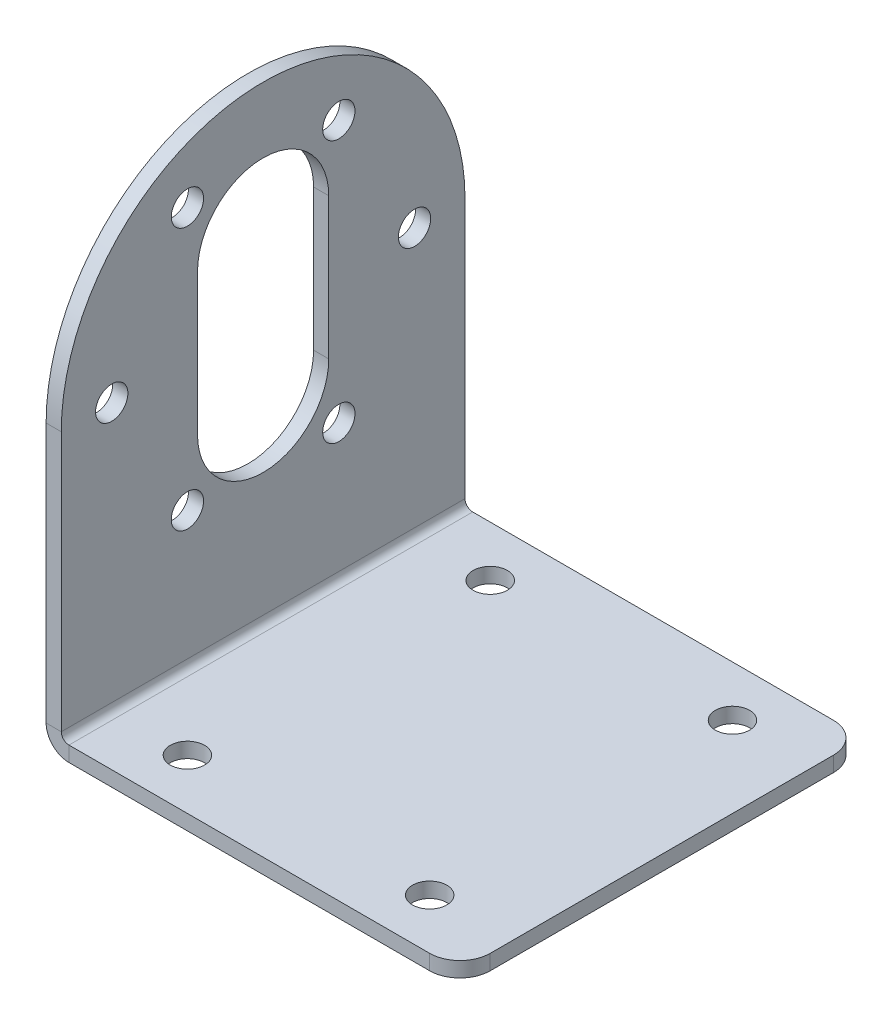
ISO-10303-21;
HEADER;
FILE_DESCRIPTION(('STEP AP214'),'2;1');
FILE_NAME('part.step','',(''),(''),'','','');
FILE_SCHEMA(('AUTOMOTIVE_DESIGN { 1 0 10303 214 1 1 1 1 }'));
ENDSEC;
DATA;
#1=APPLICATION_CONTEXT('core data for automotive mechanical design processes');
#2=APPLICATION_PROTOCOL_DEFINITION('international standard','automotive_design',2000,#1);
#3=PRODUCT_CONTEXT('',#1,'mechanical');
#4=PRODUCT('Part','Part','',(#3));
#5=PRODUCT_RELATED_PRODUCT_CATEGORY('part','',(#4));
#6=PRODUCT_DEFINITION_FORMATION('','',#4);
#7=PRODUCT_DEFINITION_CONTEXT('part definition',#1,'design');
#8=PRODUCT_DEFINITION('design','',#6,#7);
#9=PRODUCT_DEFINITION_SHAPE('','',#8);
#10=(LENGTH_UNIT() NAMED_UNIT(*) SI_UNIT(.MILLI.,.METRE.));
#11=(NAMED_UNIT(*) PLANE_ANGLE_UNIT() SI_UNIT($,.RADIAN.));
#12=(NAMED_UNIT(*) SI_UNIT($,.STERADIAN.) SOLID_ANGLE_UNIT());
#13=UNCERTAINTY_MEASURE_WITH_UNIT(LENGTH_MEASURE(1.E-05),#10,'distance_accuracy_value','');
#14=(GEOMETRIC_REPRESENTATION_CONTEXT(3) GLOBAL_UNCERTAINTY_ASSIGNED_CONTEXT((#13)) GLOBAL_UNIT_ASSIGNED_CONTEXT((#10,
#11,#12)) REPRESENTATION_CONTEXT('',''));
#15=CARTESIAN_POINT('',(0.,0.,0.));
#16=DIRECTION('',(0.,0.,1.));
#17=DIRECTION('',(1.,0.,0.));
#18=AXIS2_PLACEMENT_3D('',#15,#16,#17);
#19=CARTESIAN_POINT('',(1.5,-28.,-20.));
#20=DIRECTION('',(0.,0.,-1.));
#21=DIRECTION('',(-1.,0.,0.));
#22=AXIS2_PLACEMENT_3D('',#19,#20,#21);
#23=PLANE('',#22);
#24=DIRECTION('',(1.,0.,0.));
#25=VECTOR('',#24,1.);
#26=CARTESIAN_POINT('',(1.5,-26.5,-20.));
#27=LINE('',#26,#25);
#28=CARTESIAN_POINT('',(38.,-26.5,-20.));
#29=VERTEX_POINT('',#28);
#30=CARTESIAN_POINT('',(2.262,-26.5,-20.));
#31=VERTEX_POINT('',#30);
#32=EDGE_CURVE('E254',#29,#31,#27,.F.);
#33=ORIENTED_EDGE('',*,*,#32,.F.);
#34=DIRECTION('',(0.,1.,0.));
#35=VECTOR('',#34,1.);
#36=CARTESIAN_POINT('',(38.,-28.,-20.));
#37=LINE('',#36,#35);
#38=CARTESIAN_POINT('',(38.,-28.,-20.));
#39=VERTEX_POINT('',#38);
#40=EDGE_CURVE('E286',#29,#39,#37,.F.);
#41=ORIENTED_EDGE('',*,*,#40,.T.);
#42=DIRECTION('',(-1.,0.,0.));
#43=VECTOR('',#42,1.);
#44=CARTESIAN_POINT('',(1.5,-28.,-20.));
#45=LINE('',#44,#43);
#46=CARTESIAN_POINT('',(2.262,-28.,-20.));
#47=VERTEX_POINT('',#46);
#48=EDGE_CURVE('E206',#39,#47,#45,.T.);
#49=ORIENTED_EDGE('',*,*,#48,.T.);
#50=DIRECTION('',(0.,-1.,0.));
#51=VECTOR('',#50,1.);
#52=CARTESIAN_POINT('',(2.262,-28.,-20.));
#53=LINE('',#52,#51);
#54=EDGE_CURVE('E271',#31,#47,#53,.T.);
#55=ORIENTED_EDGE('',*,*,#54,.F.);
#56=EDGE_LOOP('',(#33,#41,#49,#55));
#57=FACE_BOUND('',#56,.T.);
#58=ADVANCED_FACE('F38',(#57),#23,.T.);
#59=CARTESIAN_POINT('',(41.,-28.,20.));
#60=DIRECTION('',(-1.,0.,0.));
#61=DIRECTION('',(0.,0.,1.));
#62=AXIS2_PLACEMENT_3D('',#59,#60,#61);
#63=PLANE('',#62);
#64=DIRECTION('',(0.,0.,1.));
#65=VECTOR('',#64,1.);
#66=CARTESIAN_POINT('',(41.,-28.,20.));
#67=LINE('',#66,#65);
#68=CARTESIAN_POINT('',(41.,-28.,-17.));
#69=VERTEX_POINT('',#68);
#70=CARTESIAN_POINT('',(41.,-28.,17.));
#71=VERTEX_POINT('',#70);
#72=EDGE_CURVE('E208',#69,#71,#67,.T.);
#73=ORIENTED_EDGE('',*,*,#72,.F.);
#74=DIRECTION('',(0.,-1.,0.));
#75=VECTOR('',#74,1.);
#76=CARTESIAN_POINT('',(41.,-28.,-17.));
#77=LINE('',#76,#75);
#78=CARTESIAN_POINT('',(41.,-26.5,-17.));
#79=VERTEX_POINT('',#78);
#80=EDGE_CURVE('E296',#69,#79,#77,.F.);
#81=ORIENTED_EDGE('',*,*,#80,.T.);
#82=DIRECTION('',(0.,0.,1.));
#83=VECTOR('',#82,1.);
#84=CARTESIAN_POINT('',(41.,-26.5,20.));
#85=LINE('',#84,#83);
#86=CARTESIAN_POINT('',(41.,-26.5,17.));
#87=VERTEX_POINT('',#86);
#88=EDGE_CURVE('E257',#79,#87,#85,.T.);
#89=ORIENTED_EDGE('',*,*,#88,.T.);
#90=DIRECTION('',(0.,1.,0.));
#91=VECTOR('',#90,1.);
#92=CARTESIAN_POINT('',(41.,-28.,17.));
#93=LINE('',#92,#91);
#94=EDGE_CURVE('E293',#87,#71,#93,.F.);
#95=ORIENTED_EDGE('',*,*,#94,.T.);
#96=EDGE_LOOP('',(#73,#81,#89,#95));
#97=FACE_BOUND('',#96,.T.);
#98=ADVANCED_FACE('F313',(#97),#63,.F.);
#99=CARTESIAN_POINT('',(1.5,-28.,20.));
#100=DIRECTION('',(0.,0.,-1.));
#101=DIRECTION('',(-1.,0.,0.));
#102=AXIS2_PLACEMENT_3D('',#99,#100,#101);
#103=PLANE('',#102);
#104=DIRECTION('',(-1.,0.,0.));
#105=VECTOR('',#104,1.);
#106=CARTESIAN_POINT('',(1.5,-28.,20.));
#107=LINE('',#106,#105);
#108=CARTESIAN_POINT('',(38.,-28.,20.));
#109=VERTEX_POINT('',#108);
#110=CARTESIAN_POINT('',(2.262,-28.,20.));
#111=VERTEX_POINT('',#110);
#112=EDGE_CURVE('E212',#109,#111,#107,.T.);
#113=ORIENTED_EDGE('',*,*,#112,.F.);
#114=DIRECTION('',(0.,1.,0.));
#115=VECTOR('',#114,1.);
#116=CARTESIAN_POINT('',(38.,-28.,20.));
#117=LINE('',#116,#115);
#118=CARTESIAN_POINT('',(38.,-26.5,20.));
#119=VERTEX_POINT('',#118);
#120=EDGE_CURVE('E11',#109,#119,#117,.T.);
#121=ORIENTED_EDGE('',*,*,#120,.T.);
#122=DIRECTION('',(1.,0.,0.));
#123=VECTOR('',#122,1.);
#124=CARTESIAN_POINT('',(1.5,-26.5,20.));
#125=LINE('',#124,#123);
#126=CARTESIAN_POINT('',(2.262,-26.5,20.));
#127=VERTEX_POINT('',#126);
#128=EDGE_CURVE('E250',#119,#127,#125,.F.);
#129=ORIENTED_EDGE('',*,*,#128,.T.);
#130=DIRECTION('',(0.,-1.,0.));
#131=VECTOR('',#130,1.);
#132=CARTESIAN_POINT('',(2.262,-28.,20.));
#133=LINE('',#132,#131);
#134=EDGE_CURVE('E268',#127,#111,#133,.T.);
#135=ORIENTED_EDGE('',*,*,#134,.T.);
#136=EDGE_LOOP('',(#113,#121,#129,#135));
#137=FACE_BOUND('',#136,.T.);
#138=ADVANCED_FACE('F316',(#137),#103,.F.);
#139=CARTESIAN_POINT('',(2.262,-25.738,20.));
#140=DIRECTION('',(0.,0.,1.));
#141=DIRECTION('',(0.,-1.,0.));
#142=AXIS2_PLACEMENT_3D('',#139,#140,#141);
#143=PLANE('',#142);
#144=ORIENTED_EDGE('',*,*,#134,.F.);
#145=CARTESIAN_POINT('',(2.262,-25.738,20.));
#146=DIRECTION('',(0.,0.,-1.));
#147=DIRECTION('',(-1.,0.,0.));
#148=AXIS2_PLACEMENT_3D('',#145,#146,#147);
#149=CIRCLE('',#148,0.762);
#150=CARTESIAN_POINT('',(1.5,-25.738,20.));
#151=VERTEX_POINT('',#150);
#152=EDGE_CURVE('E251',#127,#151,#149,.T.);
#153=ORIENTED_EDGE('',*,*,#152,.T.);
#154=DIRECTION('',(-1.,0.,0.));
#155=VECTOR('',#154,1.);
#156=CARTESIAN_POINT('',(0.,-25.738,20.));
#157=LINE('',#156,#155);
#158=CARTESIAN_POINT('',(0.,-25.738,20.));
#159=VERTEX_POINT('',#158);
#160=EDGE_CURVE('E266',#151,#159,#157,.T.);
#161=ORIENTED_EDGE('',*,*,#160,.T.);
#162=CARTESIAN_POINT('',(2.262,-25.738,20.));
#163=DIRECTION('',(0.,0.,-1.));
#164=DIRECTION('',(0.,1.,0.));
#165=AXIS2_PLACEMENT_3D('',#162,#163,#164);
#166=CIRCLE('',#165,2.262);
#167=EDGE_CURVE('E209',#111,#159,#166,.T.);
#168=ORIENTED_EDGE('',*,*,#167,.F.);
#169=EDGE_LOOP('',(#144,#153,#161,#168));
#170=FACE_BOUND('',#169,.T.);
#171=ADVANCED_FACE('F321',(#170),#143,.T.);
#172=CARTESIAN_POINT('',(0.,0.,20.));
#173=DIRECTION('',(0.,0.,1.));
#174=DIRECTION('',(0.,-1.,0.));
#175=AXIS2_PLACEMENT_3D('',#172,#173,#174);
#176=PLANE('',#175);
#177=ORIENTED_EDGE('',*,*,#160,.F.);
#178=DIRECTION('',(0.,1.,0.));
#179=VECTOR('',#178,1.);
#180=CARTESIAN_POINT('',(1.5,0.,20.));
#181=LINE('',#180,#179);
#182=CARTESIAN_POINT('',(1.5,0.,20.));
#183=VERTEX_POINT('',#182);
#184=EDGE_CURVE('E247',#183,#151,#181,.F.);
#185=ORIENTED_EDGE('',*,*,#184,.F.);
#186=DIRECTION('',(-1.,0.,0.));
#187=VECTOR('',#186,1.);
#188=CARTESIAN_POINT('',(0.,0.,20.));
#189=LINE('',#188,#187);
#190=CARTESIAN_POINT('',(0.,0.,20.));
#191=VERTEX_POINT('',#190);
#192=EDGE_CURVE('E264',#183,#191,#189,.T.);
#193=ORIENTED_EDGE('',*,*,#192,.T.);
#194=DIRECTION('',(0.,-1.,0.));
#195=VECTOR('',#194,1.);
#196=CARTESIAN_POINT('',(0.,0.,20.));
#197=LINE('',#196,#195);
#198=EDGE_CURVE('E214',#191,#159,#197,.T.);
#199=ORIENTED_EDGE('',*,*,#198,.T.);
#200=EDGE_LOOP('',(#177,#185,#193,#199));
#201=FACE_BOUND('',#200,.T.);
#202=ADVANCED_FACE('F633',(#201),#176,.T.);
#203=CARTESIAN_POINT('',(0.,0.,0.));
#204=DIRECTION('',(1.,0.,0.));
#205=DIRECTION('',(0.,0.,-1.));
#206=AXIS2_PLACEMENT_3D('',#203,#204,#205);
#207=CYLINDRICAL_SURFACE('',#206,20.);
#208=ORIENTED_EDGE('',*,*,#192,.F.);
#209=CARTESIAN_POINT('',(1.5,0.,0.));
#210=DIRECTION('',(1.,0.,0.));
#211=DIRECTION('',(0.,0.,-1.));
#212=AXIS2_PLACEMENT_3D('',#209,#210,#211);
#213=CIRCLE('',#212,20.);
#214=CARTESIAN_POINT('',(1.5,0.,-20.));
#215=VERTEX_POINT('',#214);
#216=EDGE_CURVE('E244',#215,#183,#213,.T.);
#217=ORIENTED_EDGE('',*,*,#216,.F.);
#218=DIRECTION('',(-1.,0.,0.));
#219=VECTOR('',#218,1.);
#220=CARTESIAN_POINT('',(0.,0.,-20.));
#221=LINE('',#220,#219);
#222=CARTESIAN_POINT('',(0.,0.,-20.));
#223=VERTEX_POINT('',#222);
#224=EDGE_CURVE('E262',#215,#223,#221,.T.);
#225=ORIENTED_EDGE('',*,*,#224,.T.);
#226=CARTESIAN_POINT('',(0.,0.,0.));
#227=DIRECTION('',(1.,0.,0.));
#228=DIRECTION('',(0.,0.,-1.));
#229=AXIS2_PLACEMENT_3D('',#226,#227,#228);
#230=CIRCLE('',#229,20.);
#231=EDGE_CURVE('E217',#223,#191,#230,.T.);
#232=ORIENTED_EDGE('',*,*,#231,.T.);
#233=EDGE_LOOP('',(#208,#217,#225,#232));
#234=FACE_BOUND('',#233,.T.);
#235=ADVANCED_FACE('F624',(#234),#207,.T.);
#236=CARTESIAN_POINT('',(0.,0.,-20.));
#237=DIRECTION('',(0.,0.,-1.));
#238=DIRECTION('',(0.,1.,0.));
#239=AXIS2_PLACEMENT_3D('',#236,#237,#238);
#240=PLANE('',#239);
#241=ORIENTED_EDGE('',*,*,#224,.F.);
#242=DIRECTION('',(0.,1.,0.));
#243=VECTOR('',#242,1.);
#244=CARTESIAN_POINT('',(1.5,0.,-20.));
#245=LINE('',#244,#243);
#246=CARTESIAN_POINT('',(1.5,-25.738,-20.));
#247=VERTEX_POINT('',#246);
#248=EDGE_CURVE('E241',#247,#215,#245,.T.);
#249=ORIENTED_EDGE('',*,*,#248,.F.);
#250=DIRECTION('',(-1.,0.,0.));
#251=VECTOR('',#250,1.);
#252=CARTESIAN_POINT('',(0.,-25.738,-20.));
#253=LINE('',#252,#251);
#254=CARTESIAN_POINT('',(0.,-25.738,-20.));
#255=VERTEX_POINT('',#254);
#256=EDGE_CURVE('E229',#247,#255,#253,.T.);
#257=ORIENTED_EDGE('',*,*,#256,.T.);
#258=DIRECTION('',(0.,1.,0.));
#259=VECTOR('',#258,1.);
#260=CARTESIAN_POINT('',(0.,0.,-20.));
#261=LINE('',#260,#259);
#262=EDGE_CURVE('E220',#255,#223,#261,.T.);
#263=ORIENTED_EDGE('',*,*,#262,.T.);
#264=EDGE_LOOP('',(#241,#249,#257,#263));
#265=FACE_BOUND('',#264,.T.);
#266=ADVANCED_FACE('F334',(#265),#240,.T.);
#267=CARTESIAN_POINT('',(2.262,-25.738,-20.));
#268=DIRECTION('',(0.,0.,1.));
#269=DIRECTION('',(0.,-1.,0.));
#270=AXIS2_PLACEMENT_3D('',#267,#268,#269);
#271=PLANE('',#270);
#272=CARTESIAN_POINT('',(2.262,-25.738,-20.));
#273=DIRECTION('',(0.,0.,-1.));
#274=DIRECTION('',(-1.,0.,0.));
#275=AXIS2_PLACEMENT_3D('',#272,#273,#274);
#276=CIRCLE('',#275,0.762);
#277=EDGE_CURVE('E255',#247,#31,#276,.F.);
#278=ORIENTED_EDGE('',*,*,#277,.T.);
#279=ORIENTED_EDGE('',*,*,#54,.T.);
#280=CARTESIAN_POINT('',(2.262,-25.738,-20.));
#281=DIRECTION('',(0.,0.,-1.));
#282=DIRECTION('',(0.,1.,0.));
#283=AXIS2_PLACEMENT_3D('',#280,#281,#282);
#284=CIRCLE('',#283,2.262);
#285=EDGE_CURVE('E230',#255,#47,#284,.F.);
#286=ORIENTED_EDGE('',*,*,#285,.F.);
#287=ORIENTED_EDGE('',*,*,#256,.F.);
#288=EDGE_LOOP('',(#278,#279,#286,#287));
#289=FACE_BOUND('',#288,.T.);
#290=ADVANCED_FACE('F328',(#289),#271,.F.);
#291=CARTESIAN_POINT('',(0.,0.,0.));
#292=DIRECTION('',(1.,0.,0.));
#293=DIRECTION('',(0.,0.,-1.));
#294=AXIS2_PLACEMENT_3D('',#291,#292,#293);
#295=PLANE('',#294);
#296=DIRECTION('',(0.,-1.,0.));
#297=VECTOR('',#296,1.);
#298=CARTESIAN_POINT('',(0.,7.,-6.5));
#299=LINE('',#298,#297);
#300=CARTESIAN_POINT('',(0.,7.,-6.5));
#301=VERTEX_POINT('',#300);
#302=CARTESIAN_POINT('',(0.,-7.,-6.5));
#303=VERTEX_POINT('',#302);
#304=EDGE_CURVE('E155',#301,#303,#299,.T.);
#305=ORIENTED_EDGE('',*,*,#304,.F.);
#306=CARTESIAN_POINT('',(0.,7.,0.));
#307=DIRECTION('',(-1.,0.,0.));
#308=DIRECTION('',(0.,0.,1.));
#309=AXIS2_PLACEMENT_3D('',#306,#307,#308);
#310=CIRCLE('',#309,6.5);
#311=CARTESIAN_POINT('',(0.,7.,6.5));
#312=VERTEX_POINT('',#311);
#313=EDGE_CURVE('E160',#312,#301,#310,.T.);
#314=ORIENTED_EDGE('',*,*,#313,.F.);
#315=DIRECTION('',(0.,1.,0.));
#316=VECTOR('',#315,1.);
#317=CARTESIAN_POINT('',(0.,7.,6.5));
#318=LINE('',#317,#316);
#319=CARTESIAN_POINT('',(0.,-7.,6.5));
#320=VERTEX_POINT('',#319);
#321=EDGE_CURVE('E165',#320,#312,#318,.T.);
#322=ORIENTED_EDGE('',*,*,#321,.F.);
#323=CARTESIAN_POINT('',(0.,-7.,0.));
#324=DIRECTION('',(-1.,0.,0.));
#325=DIRECTION('',(0.,0.,1.));
#326=AXIS2_PLACEMENT_3D('',#323,#324,#325);
#327=CIRCLE('',#326,6.5);
#328=EDGE_CURVE('E144',#303,#320,#327,.T.);
#329=ORIENTED_EDGE('',*,*,#328,.F.);
#330=EDGE_LOOP('',(#305,#314,#322,#329));
#331=FACE_BOUND('',#330,.T.);
#332=CARTESIAN_POINT('',(0.,-12.9903810567665,-7.50000000000015));
#333=DIRECTION('',(-1.,0.,0.));
#334=DIRECTION('',(0.,0.,1.));
#335=AXIS2_PLACEMENT_3D('',#332,#333,#334);
#336=CIRCLE('',#335,1.6);
#337=CARTESIAN_POINT('',(0.,-12.9903810567665,-5.90000000000015));
#338=VERTEX_POINT('',#337);
#339=EDGE_CURVE('E172',#338,#338,#336,.T.);
#340=ORIENTED_EDGE('',*,*,#339,.F.);
#341=EDGE_LOOP('',(#340));
#342=FACE_BOUND('',#341,.T.);
#343=CARTESIAN_POINT('',(0.,-12.9903810567666,7.49999999999988));
#344=DIRECTION('',(-1.,0.,0.));
#345=DIRECTION('',(0.,0.,1.));
#346=AXIS2_PLACEMENT_3D('',#343,#344,#345);
#347=CIRCLE('',#346,1.6);
#348=CARTESIAN_POINT('',(0.,-12.9903810567666,9.09999999999988));
#349=VERTEX_POINT('',#348);
#350=EDGE_CURVE('E180',#349,#349,#347,.T.);
#351=ORIENTED_EDGE('',*,*,#350,.F.);
#352=EDGE_LOOP('',(#351));
#353=FACE_BOUND('',#352,.T.);
#354=CARTESIAN_POINT('',(0.,0.,15.));
#355=DIRECTION('',(-1.,0.,0.));
#356=DIRECTION('',(0.,0.,1.));
#357=AXIS2_PLACEMENT_3D('',#354,#355,#356);
#358=CIRCLE('',#357,1.6);
#359=CARTESIAN_POINT('',(0.,0.,16.6));
#360=VERTEX_POINT('',#359);
#361=EDGE_CURVE('E186',#360,#360,#358,.T.);
#362=ORIENTED_EDGE('',*,*,#361,.F.);
#363=EDGE_LOOP('',(#362));
#364=FACE_BOUND('',#363,.T.);
#365=CARTESIAN_POINT('',(0.,12.9903810567665,7.50000000000006));
#366=DIRECTION('',(-1.,0.,0.));
#367=DIRECTION('',(0.,0.,1.));
#368=AXIS2_PLACEMENT_3D('',#365,#366,#367);
#369=CIRCLE('',#368,1.6);
#370=CARTESIAN_POINT('',(0.,12.9903810567665,9.10000000000006));
#371=VERTEX_POINT('',#370);
#372=EDGE_CURVE('E192',#371,#371,#369,.T.);
#373=ORIENTED_EDGE('',*,*,#372,.F.);
#374=EDGE_LOOP('',(#373));
#375=FACE_BOUND('',#374,.T.);
#376=CARTESIAN_POINT('',(0.,12.9903810567666,-7.49999999999997));
#377=DIRECTION('',(-1.,0.,0.));
#378=DIRECTION('',(0.,0.,1.));
#379=AXIS2_PLACEMENT_3D('',#376,#377,#378);
#380=CIRCLE('',#379,1.6);
#381=CARTESIAN_POINT('',(0.,12.9903810567666,-5.89999999999997));
#382=VERTEX_POINT('',#381);
#383=EDGE_CURVE('E198',#382,#382,#380,.T.);
#384=ORIENTED_EDGE('',*,*,#383,.F.);
#385=EDGE_LOOP('',(#384));
#386=FACE_BOUND('',#385,.T.);
#387=CARTESIAN_POINT('',(0.,0.,-15.));
#388=DIRECTION('',(-1.,0.,0.));
#389=DIRECTION('',(0.,0.,1.));
#390=AXIS2_PLACEMENT_3D('',#387,#388,#389);
#391=CIRCLE('',#390,1.6);
#392=CARTESIAN_POINT('',(0.,0.,-13.4));
#393=VERTEX_POINT('',#392);
#394=EDGE_CURVE('E202',#393,#393,#391,.T.);
#395=ORIENTED_EDGE('',*,*,#394,.F.);
#396=EDGE_LOOP('',(#395));
#397=FACE_BOUND('',#396,.T.);
#398=ORIENTED_EDGE('',*,*,#262,.F.);
#399=DIRECTION('',(0.,0.,-1.));
#400=VECTOR('',#399,1.);
#401=CARTESIAN_POINT('',(0.,-25.738,0.));
#402=LINE('',#401,#400);
#403=EDGE_CURVE('E226',#255,#159,#402,.F.);
#404=ORIENTED_EDGE('',*,*,#403,.T.);
#405=ORIENTED_EDGE('',*,*,#198,.F.);
#406=ORIENTED_EDGE('',*,*,#231,.F.);
#407=EDGE_LOOP('',(#398,#404,#405,#406));
#408=FACE_BOUND('',#407,.T.);
#409=ADVANCED_FACE('F162',(#331,#342,#353,#364,#375,#386,#397,#408),#295,.F.);
#410=CARTESIAN_POINT('',(1.5,-28.,20.));
#411=DIRECTION('',(0.,1.,0.));
#412=DIRECTION('',(0.,0.,1.));
#413=AXIS2_PLACEMENT_3D('',#410,#411,#412);
#414=PLANE('',#413);
#415=CARTESIAN_POINT('',(9.00000000000001,-28.,-15.));
#416=DIRECTION('',(0.,1.,0.));
#417=DIRECTION('',(0.,0.,1.));
#418=AXIS2_PLACEMENT_3D('',#415,#416,#417);
#419=CIRCLE('',#418,1.7);
#420=CARTESIAN_POINT('',(9.00000000000001,-28.,-13.3));
#421=VERTEX_POINT('',#420);
#422=EDGE_CURVE('E487',#421,#421,#419,.T.);
#423=ORIENTED_EDGE('',*,*,#422,.T.);
#424=EDGE_LOOP('',(#423));
#425=FACE_BOUND('',#424,.T.);
#426=CARTESIAN_POINT('',(9.00000000000001,-28.,15.));
#427=DIRECTION('',(0.,1.,0.));
#428=DIRECTION('',(0.,0.,1.));
#429=AXIS2_PLACEMENT_3D('',#426,#427,#428);
#430=CIRCLE('',#429,1.7);
#431=CARTESIAN_POINT('',(9.00000000000001,-28.,16.7));
#432=VERTEX_POINT('',#431);
#433=EDGE_CURVE('E481',#432,#432,#430,.T.);
#434=ORIENTED_EDGE('',*,*,#433,.T.);
#435=EDGE_LOOP('',(#434));
#436=FACE_BOUND('',#435,.T.);
#437=CARTESIAN_POINT('',(33.,-28.,15.));
#438=DIRECTION('',(0.,1.,0.));
#439=DIRECTION('',(0.,0.,1.));
#440=AXIS2_PLACEMENT_3D('',#437,#438,#439);
#441=CIRCLE('',#440,1.7);
#442=CARTESIAN_POINT('',(33.,-28.,16.7));
#443=VERTEX_POINT('',#442);
#444=EDGE_CURVE('E472',#443,#443,#441,.T.);
#445=ORIENTED_EDGE('',*,*,#444,.T.);
#446=EDGE_LOOP('',(#445));
#447=FACE_BOUND('',#446,.T.);
#448=CARTESIAN_POINT('',(33.,-28.,-15.));
#449=DIRECTION('',(0.,1.,0.));
#450=DIRECTION('',(0.,0.,1.));
#451=AXIS2_PLACEMENT_3D('',#448,#449,#450);
#452=CIRCLE('',#451,1.7);
#453=CARTESIAN_POINT('',(33.,-28.,-13.3));
#454=VERTEX_POINT('',#453);
#455=EDGE_CURVE('E465',#454,#454,#452,.T.);
#456=ORIENTED_EDGE('',*,*,#455,.T.);
#457=EDGE_LOOP('',(#456));
#458=FACE_BOUND('',#457,.T.);
#459=ORIENTED_EDGE('',*,*,#48,.F.);
#460=CARTESIAN_POINT('',(38.,-28.,-17.));
#461=DIRECTION('',(0.,1.,0.));
#462=DIRECTION('',(0.,0.,1.));
#463=AXIS2_PLACEMENT_3D('',#460,#461,#462);
#464=CIRCLE('',#463,3.);
#465=EDGE_CURVE('E291',#39,#69,#464,.F.);
#466=ORIENTED_EDGE('',*,*,#465,.T.);
#467=ORIENTED_EDGE('',*,*,#72,.T.);
#468=CARTESIAN_POINT('',(38.,-28.,17.));
#469=DIRECTION('',(0.,1.,0.));
#470=DIRECTION('',(0.,0.,1.));
#471=AXIS2_PLACEMENT_3D('',#468,#469,#470);
#472=CIRCLE('',#471,3.);
#473=EDGE_CURVE('E289',#71,#109,#472,.F.);
#474=ORIENTED_EDGE('',*,*,#473,.T.);
#475=ORIENTED_EDGE('',*,*,#112,.T.);
#476=DIRECTION('',(0.,0.,-1.));
#477=VECTOR('',#476,1.);
#478=CARTESIAN_POINT('',(2.262,-28.,20.));
#479=LINE('',#478,#477);
#480=EDGE_CURVE('E223',#111,#47,#479,.T.);
#481=ORIENTED_EDGE('',*,*,#480,.T.);
#482=EDGE_LOOP('',(#459,#466,#467,#474,#475,#481));
#483=FACE_BOUND('',#482,.T.);
#484=ADVANCED_FACE('F311',(#425,#436,#447,#458,#483),#414,.F.);
#485=CARTESIAN_POINT('',(2.262,-25.738,20.));
#486=DIRECTION('',(0.,0.,-1.));
#487=DIRECTION('',(-1.,0.,0.));
#488=AXIS2_PLACEMENT_3D('',#485,#486,#487);
#489=CYLINDRICAL_SURFACE('',#488,2.262);
#490=ORIENTED_EDGE('',*,*,#167,.T.);
#491=ORIENTED_EDGE('',*,*,#403,.F.);
#492=ORIENTED_EDGE('',*,*,#285,.T.);
#493=ORIENTED_EDGE('',*,*,#480,.F.);
#494=EDGE_LOOP('',(#490,#491,#492,#493));
#495=FACE_BOUND('',#494,.T.);
#496=ADVANCED_FACE('F324',(#495),#489,.T.);
#497=CARTESIAN_POINT('',(1.5,0.,0.));
#498=DIRECTION('',(1.,0.,0.));
#499=DIRECTION('',(0.,0.,-1.));
#500=AXIS2_PLACEMENT_3D('',#497,#498,#499);
#501=PLANE('',#500);
#502=CARTESIAN_POINT('',(1.5,7.,0.));
#503=DIRECTION('',(1.,0.,0.));
#504=DIRECTION('',(0.,0.,-1.));
#505=AXIS2_PLACEMENT_3D('',#502,#503,#504);
#506=CIRCLE('',#505,6.5);
#507=CARTESIAN_POINT('',(1.50000000000002,7.,-6.5));
#508=VERTEX_POINT('',#507);
#509=CARTESIAN_POINT('',(1.50000000000002,7.,6.5));
#510=VERTEX_POINT('',#509);
#511=EDGE_CURVE('E284',#508,#510,#506,.T.);
#512=ORIENTED_EDGE('',*,*,#511,.F.);
#513=DIRECTION('',(0.,1.,0.));
#514=VECTOR('',#513,1.);
#515=CARTESIAN_POINT('',(1.5,0.,-6.5));
#516=LINE('',#515,#514);
#517=CARTESIAN_POINT('',(1.5,-7.,-6.5));
#518=VERTEX_POINT('',#517);
#519=EDGE_CURVE('E274',#518,#508,#516,.T.);
#520=ORIENTED_EDGE('',*,*,#519,.F.);
#521=CARTESIAN_POINT('',(1.5,-7.,0.));
#522=DIRECTION('',(1.,0.,0.));
#523=DIRECTION('',(0.,0.,-1.));
#524=AXIS2_PLACEMENT_3D('',#521,#522,#523);
#525=CIRCLE('',#524,6.5);
#526=CARTESIAN_POINT('',(1.50000000000002,-7.,6.5));
#527=VERTEX_POINT('',#526);
#528=EDGE_CURVE('E147',#527,#518,#525,.T.);
#529=ORIENTED_EDGE('',*,*,#528,.F.);
#530=DIRECTION('',(0.,-1.,0.));
#531=VECTOR('',#530,1.);
#532=CARTESIAN_POINT('',(1.5,0.,6.5));
#533=LINE('',#532,#531);
#534=EDGE_CURVE('E282',#510,#527,#533,.T.);
#535=ORIENTED_EDGE('',*,*,#534,.F.);
#536=EDGE_LOOP('',(#512,#520,#529,#535));
#537=FACE_BOUND('',#536,.T.);
#538=CARTESIAN_POINT('',(1.5,-12.9903810567665,-7.50000000000015));
#539=DIRECTION('',(1.,0.,0.));
#540=DIRECTION('',(0.,0.,-1.));
#541=AXIS2_PLACEMENT_3D('',#538,#539,#540);
#542=CIRCLE('',#541,1.59999999999999);
#543=CARTESIAN_POINT('',(1.5,-12.9903810567665,-9.10000000000014));
#544=VERTEX_POINT('',#543);
#545=EDGE_CURVE('E177',#544,#544,#542,.T.);
#546=ORIENTED_EDGE('',*,*,#545,.F.);
#547=EDGE_LOOP('',(#546));
#548=FACE_BOUND('',#547,.T.);
#549=CARTESIAN_POINT('',(1.5,-12.9903810567666,7.49999999999988));
#550=DIRECTION('',(1.,0.,0.));
#551=DIRECTION('',(0.,0.,-1.));
#552=AXIS2_PLACEMENT_3D('',#549,#550,#551);
#553=CIRCLE('',#552,1.59999999999999);
#554=CARTESIAN_POINT('',(1.5,-12.9903810567666,5.89999999999989));
#555=VERTEX_POINT('',#554);
#556=EDGE_CURVE('E183',#555,#555,#553,.T.);
#557=ORIENTED_EDGE('',*,*,#556,.F.);
#558=EDGE_LOOP('',(#557));
#559=FACE_BOUND('',#558,.T.);
#560=CARTESIAN_POINT('',(1.5,0.,15.));
#561=DIRECTION('',(1.,0.,0.));
#562=DIRECTION('',(0.,0.,-1.));
#563=AXIS2_PLACEMENT_3D('',#560,#561,#562);
#564=CIRCLE('',#563,1.59999999999999);
#565=CARTESIAN_POINT('',(1.5,0.,13.4));
#566=VERTEX_POINT('',#565);
#567=EDGE_CURVE('E189',#566,#566,#564,.T.);
#568=ORIENTED_EDGE('',*,*,#567,.F.);
#569=EDGE_LOOP('',(#568));
#570=FACE_BOUND('',#569,.T.);
#571=CARTESIAN_POINT('',(1.5,12.9903810567665,7.50000000000006));
#572=DIRECTION('',(1.,0.,0.));
#573=DIRECTION('',(0.,0.,-1.));
#574=AXIS2_PLACEMENT_3D('',#571,#572,#573);
#575=CIRCLE('',#574,1.59999999999999);
#576=CARTESIAN_POINT('',(1.5,12.9903810567665,5.90000000000007));
#577=VERTEX_POINT('',#576);
#578=EDGE_CURVE('E195',#577,#577,#575,.T.);
#579=ORIENTED_EDGE('',*,*,#578,.F.);
#580=EDGE_LOOP('',(#579));
#581=FACE_BOUND('',#580,.T.);
#582=CARTESIAN_POINT('',(1.5,12.9903810567666,-7.49999999999997));
#583=DIRECTION('',(1.,0.,0.));
#584=DIRECTION('',(0.,0.,-1.));
#585=AXIS2_PLACEMENT_3D('',#582,#583,#584);
#586=CIRCLE('',#585,1.59999999999999);
#587=CARTESIAN_POINT('',(1.5,12.9903810567666,-9.09999999999997));
#588=VERTEX_POINT('',#587);
#589=EDGE_CURVE('E201',#588,#588,#586,.T.);
#590=ORIENTED_EDGE('',*,*,#589,.F.);
#591=EDGE_LOOP('',(#590));
#592=FACE_BOUND('',#591,.T.);
#593=CARTESIAN_POINT('',(1.5,0.,-15.));
#594=DIRECTION('',(1.,0.,0.));
#595=DIRECTION('',(0.,0.,-1.));
#596=AXIS2_PLACEMENT_3D('',#593,#594,#595);
#597=CIRCLE('',#596,1.59999999999999);
#598=CARTESIAN_POINT('',(1.5,0.,-16.6));
#599=VERTEX_POINT('',#598);
#600=EDGE_CURVE('E205',#599,#599,#597,.T.);
#601=ORIENTED_EDGE('',*,*,#600,.F.);
#602=EDGE_LOOP('',(#601));
#603=FACE_BOUND('',#602,.T.);
#604=ORIENTED_EDGE('',*,*,#248,.T.);
#605=ORIENTED_EDGE('',*,*,#216,.T.);
#606=ORIENTED_EDGE('',*,*,#184,.T.);
#607=DIRECTION('',(0.,0.,-1.));
#608=VECTOR('',#607,1.);
#609=CARTESIAN_POINT('',(1.5,-25.738,0.));
#610=LINE('',#609,#608);
#611=EDGE_CURVE('E233',#247,#151,#610,.F.);
#612=ORIENTED_EDGE('',*,*,#611,.F.);
#613=EDGE_LOOP('',(#604,#605,#606,#612));
#614=FACE_BOUND('',#613,.T.);
#615=ADVANCED_FACE('F338',(#537,#548,#559,#570,#581,#592,#603,#614),#501,.T.);
#616=CARTESIAN_POINT('',(1.5,-26.5,20.));
#617=DIRECTION('',(0.,1.,0.));
#618=DIRECTION('',(0.,0.,1.));
#619=AXIS2_PLACEMENT_3D('',#616,#617,#618);
#620=PLANE('',#619);
#621=CARTESIAN_POINT('',(9.00000000000001,-26.5,-15.));
#622=DIRECTION('',(0.,1.,0.));
#623=DIRECTION('',(0.,0.,1.));
#624=AXIS2_PLACEMENT_3D('',#621,#622,#623);
#625=CIRCLE('',#624,1.7);
#626=CARTESIAN_POINT('',(9.00000000000001,-26.5,-13.3));
#627=VERTEX_POINT('',#626);
#628=EDGE_CURVE('E484',#627,#627,#625,.T.);
#629=ORIENTED_EDGE('',*,*,#628,.F.);
#630=EDGE_LOOP('',(#629));
#631=FACE_BOUND('',#630,.T.);
#632=CARTESIAN_POINT('',(9.00000000000001,-26.5,15.));
#633=DIRECTION('',(0.,1.,0.));
#634=DIRECTION('',(0.,0.,1.));
#635=AXIS2_PLACEMENT_3D('',#632,#633,#634);
#636=CIRCLE('',#635,1.7);
#637=CARTESIAN_POINT('',(9.00000000000001,-26.5,16.7));
#638=VERTEX_POINT('',#637);
#639=EDGE_CURVE('E478',#638,#638,#636,.T.);
#640=ORIENTED_EDGE('',*,*,#639,.F.);
#641=EDGE_LOOP('',(#640));
#642=FACE_BOUND('',#641,.T.);
#643=CARTESIAN_POINT('',(33.,-26.5,15.));
#644=DIRECTION('',(0.,1.,0.));
#645=DIRECTION('',(0.,0.,1.));
#646=AXIS2_PLACEMENT_3D('',#643,#644,#645);
#647=CIRCLE('',#646,1.7);
#648=CARTESIAN_POINT('',(33.,-26.5,16.7));
#649=VERTEX_POINT('',#648);
#650=EDGE_CURVE('E475',#649,#649,#647,.T.);
#651=ORIENTED_EDGE('',*,*,#650,.F.);
#652=EDGE_LOOP('',(#651));
#653=FACE_BOUND('',#652,.T.);
#654=CARTESIAN_POINT('',(33.,-26.5,-15.));
#655=DIRECTION('',(0.,1.,0.));
#656=DIRECTION('',(0.,0.,1.));
#657=AXIS2_PLACEMENT_3D('',#654,#655,#656);
#658=CIRCLE('',#657,1.7);
#659=CARTESIAN_POINT('',(33.,-26.5,-13.3));
#660=VERTEX_POINT('',#659);
#661=EDGE_CURVE('E467',#660,#660,#658,.T.);
#662=ORIENTED_EDGE('',*,*,#661,.F.);
#663=EDGE_LOOP('',(#662));
#664=FACE_BOUND('',#663,.T.);
#665=ORIENTED_EDGE('',*,*,#88,.F.);
#666=CARTESIAN_POINT('',(38.,-26.5,-17.));
#667=DIRECTION('',(0.,1.,0.));
#668=DIRECTION('',(0.,0.,1.));
#669=AXIS2_PLACEMENT_3D('',#666,#667,#668);
#670=CIRCLE('',#669,3.);
#671=EDGE_CURVE('E46',#79,#29,#670,.T.);
#672=ORIENTED_EDGE('',*,*,#671,.T.);
#673=ORIENTED_EDGE('',*,*,#32,.T.);
#674=DIRECTION('',(0.,0.,1.));
#675=VECTOR('',#674,1.);
#676=CARTESIAN_POINT('',(2.262,-26.5,20.));
#677=LINE('',#676,#675);
#678=EDGE_CURVE('E238',#127,#31,#677,.F.);
#679=ORIENTED_EDGE('',*,*,#678,.F.);
#680=ORIENTED_EDGE('',*,*,#128,.F.);
#681=CARTESIAN_POINT('',(38.,-26.5,17.));
#682=DIRECTION('',(0.,1.,0.));
#683=DIRECTION('',(0.,0.,1.));
#684=AXIS2_PLACEMENT_3D('',#681,#682,#683);
#685=CIRCLE('',#684,3.);
#686=EDGE_CURVE('E58',#119,#87,#685,.T.);
#687=ORIENTED_EDGE('',*,*,#686,.T.);
#688=EDGE_LOOP('',(#665,#672,#673,#679,#680,#687));
#689=FACE_BOUND('',#688,.T.);
#690=ADVANCED_FACE('F300',(#631,#642,#653,#664,#689),#620,.T.);
#691=CARTESIAN_POINT('',(2.262,-25.738,20.));
#692=DIRECTION('',(0.,0.,-1.));
#693=DIRECTION('',(-1.,0.,0.));
#694=AXIS2_PLACEMENT_3D('',#691,#692,#693);
#695=CYLINDRICAL_SURFACE('',#694,0.762);
#696=ORIENTED_EDGE('',*,*,#152,.F.);
#697=ORIENTED_EDGE('',*,*,#678,.T.);
#698=ORIENTED_EDGE('',*,*,#277,.F.);
#699=ORIENTED_EDGE('',*,*,#611,.T.);
#700=EDGE_LOOP('',(#696,#697,#698,#699));
#701=FACE_BOUND('',#700,.T.);
#702=ADVANCED_FACE('F343',(#701),#695,.F.);
#703=CARTESIAN_POINT('',(0.,0.,-15.));
#704=DIRECTION('',(-1.,0.,0.));
#705=DIRECTION('',(0.,0.,1.));
#706=AXIS2_PLACEMENT_3D('',#703,#704,#705);
#707=CYLINDRICAL_SURFACE('',#706,1.59999999999999);
#708=ORIENTED_EDGE('',*,*,#600,.T.);
#709=EDGE_LOOP('',(#708));
#710=FACE_BOUND('',#709,.T.);
#711=ORIENTED_EDGE('',*,*,#394,.T.);
#712=EDGE_LOOP('',(#711));
#713=FACE_BOUND('',#712,.T.);
#714=ADVANCED_FACE('F345',(#710,#713),#707,.F.);
#715=CARTESIAN_POINT('',(0.,12.9903810567666,-7.49999999999997));
#716=DIRECTION('',(-1.,0.,0.));
#717=DIRECTION('',(0.,0.,1.));
#718=AXIS2_PLACEMENT_3D('',#715,#716,#717);
#719=CYLINDRICAL_SURFACE('',#718,1.59999999999999);
#720=ORIENTED_EDGE('',*,*,#589,.T.);
#721=EDGE_LOOP('',(#720));
#722=FACE_BOUND('',#721,.T.);
#723=ORIENTED_EDGE('',*,*,#383,.T.);
#724=EDGE_LOOP('',(#723));
#725=FACE_BOUND('',#724,.T.);
#726=ADVANCED_FACE('F351',(#722,#725),#719,.F.);
#727=CARTESIAN_POINT('',(0.,12.9903810567665,7.50000000000006));
#728=DIRECTION('',(-1.,0.,0.));
#729=DIRECTION('',(0.,0.,1.));
#730=AXIS2_PLACEMENT_3D('',#727,#728,#729);
#731=CYLINDRICAL_SURFACE('',#730,1.59999999999999);
#732=ORIENTED_EDGE('',*,*,#578,.T.);
#733=EDGE_LOOP('',(#732));
#734=FACE_BOUND('',#733,.T.);
#735=ORIENTED_EDGE('',*,*,#372,.T.);
#736=EDGE_LOOP('',(#735));
#737=FACE_BOUND('',#736,.T.);
#738=ADVANCED_FACE('F414',(#734,#737),#731,.F.);
#739=CARTESIAN_POINT('',(0.,0.,15.));
#740=DIRECTION('',(-1.,0.,0.));
#741=DIRECTION('',(0.,0.,1.));
#742=AXIS2_PLACEMENT_3D('',#739,#740,#741);
#743=CYLINDRICAL_SURFACE('',#742,1.59999999999999);
#744=ORIENTED_EDGE('',*,*,#567,.T.);
#745=EDGE_LOOP('',(#744));
#746=FACE_BOUND('',#745,.T.);
#747=ORIENTED_EDGE('',*,*,#361,.T.);
#748=EDGE_LOOP('',(#747));
#749=FACE_BOUND('',#748,.T.);
#750=ADVANCED_FACE('F410',(#746,#749),#743,.F.);
#751=CARTESIAN_POINT('',(0.,-12.9903810567666,7.49999999999988));
#752=DIRECTION('',(-1.,0.,0.));
#753=DIRECTION('',(0.,0.,1.));
#754=AXIS2_PLACEMENT_3D('',#751,#752,#753);
#755=CYLINDRICAL_SURFACE('',#754,1.59999999999999);
#756=ORIENTED_EDGE('',*,*,#556,.T.);
#757=EDGE_LOOP('',(#756));
#758=FACE_BOUND('',#757,.T.);
#759=ORIENTED_EDGE('',*,*,#350,.T.);
#760=EDGE_LOOP('',(#759));
#761=FACE_BOUND('',#760,.T.);
#762=ADVANCED_FACE('F406',(#758,#761),#755,.F.);
#763=CARTESIAN_POINT('',(0.,-12.9903810567665,-7.50000000000015));
#764=DIRECTION('',(-1.,0.,0.));
#765=DIRECTION('',(0.,0.,1.));
#766=AXIS2_PLACEMENT_3D('',#763,#764,#765);
#767=CYLINDRICAL_SURFACE('',#766,1.59999999999999);
#768=ORIENTED_EDGE('',*,*,#545,.T.);
#769=EDGE_LOOP('',(#768));
#770=FACE_BOUND('',#769,.T.);
#771=ORIENTED_EDGE('',*,*,#339,.T.);
#772=EDGE_LOOP('',(#771));
#773=FACE_BOUND('',#772,.T.);
#774=ADVANCED_FACE('F402',(#770,#773),#767,.F.);
#775=CARTESIAN_POINT('',(41.,7.,0.));
#776=DIRECTION('',(-1.,0.,0.));
#777=DIRECTION('',(0.,0.,1.));
#778=AXIS2_PLACEMENT_3D('',#775,#776,#777);
#779=CYLINDRICAL_SURFACE('',#778,6.5);
#780=ORIENTED_EDGE('',*,*,#511,.T.);
#781=DIRECTION('',(-1.,0.,0.));
#782=VECTOR('',#781,1.);
#783=CARTESIAN_POINT('',(41.,7.,6.5));
#784=LINE('',#783,#782);
#785=EDGE_CURVE('E170',#510,#312,#784,.T.);
#786=ORIENTED_EDGE('',*,*,#785,.T.);
#787=ORIENTED_EDGE('',*,*,#313,.T.);
#788=DIRECTION('',(-1.,0.,0.));
#789=VECTOR('',#788,1.);
#790=CARTESIAN_POINT('',(41.,7.,-6.5));
#791=LINE('',#790,#789);
#792=EDGE_CURVE('E151',#508,#301,#791,.T.);
#793=ORIENTED_EDGE('',*,*,#792,.F.);
#794=EDGE_LOOP('',(#780,#786,#787,#793));
#795=FACE_BOUND('',#794,.T.);
#796=ADVANCED_FACE('F394',(#795),#779,.F.);
#797=CARTESIAN_POINT('',(41.,7.,6.5));
#798=DIRECTION('',(0.,0.,1.));
#799=DIRECTION('',(0.,-1.,0.));
#800=AXIS2_PLACEMENT_3D('',#797,#798,#799);
#801=PLANE('',#800);
#802=ORIENTED_EDGE('',*,*,#534,.T.);
#803=DIRECTION('',(-1.,0.,0.));
#804=VECTOR('',#803,1.);
#805=CARTESIAN_POINT('',(41.,-7.,6.5));
#806=LINE('',#805,#804);
#807=EDGE_CURVE('E150',#527,#320,#806,.T.);
#808=ORIENTED_EDGE('',*,*,#807,.T.);
#809=ORIENTED_EDGE('',*,*,#321,.T.);
#810=ORIENTED_EDGE('',*,*,#785,.F.);
#811=EDGE_LOOP('',(#802,#808,#809,#810));
#812=FACE_BOUND('',#811,.T.);
#813=ADVANCED_FACE('F391',(#812),#801,.F.);
#814=CARTESIAN_POINT('',(41.,-7.,0.));
#815=DIRECTION('',(-1.,0.,0.));
#816=DIRECTION('',(0.,0.,1.));
#817=AXIS2_PLACEMENT_3D('',#814,#815,#816);
#818=CYLINDRICAL_SURFACE('',#817,6.5);
#819=ORIENTED_EDGE('',*,*,#528,.T.);
#820=DIRECTION('',(-1.,0.,0.));
#821=VECTOR('',#820,1.);
#822=CARTESIAN_POINT('',(41.,-7.,-6.5));
#823=LINE('',#822,#821);
#824=EDGE_CURVE('E139',#518,#303,#823,.T.);
#825=ORIENTED_EDGE('',*,*,#824,.T.);
#826=ORIENTED_EDGE('',*,*,#328,.T.);
#827=ORIENTED_EDGE('',*,*,#807,.F.);
#828=EDGE_LOOP('',(#819,#825,#826,#827));
#829=FACE_BOUND('',#828,.T.);
#830=ADVANCED_FACE('F141',(#829),#818,.F.);
#831=CARTESIAN_POINT('',(41.,7.,-6.5));
#832=DIRECTION('',(0.,0.,-1.));
#833=DIRECTION('',(0.,1.,0.));
#834=AXIS2_PLACEMENT_3D('',#831,#832,#833);
#835=PLANE('',#834);
#836=ORIENTED_EDGE('',*,*,#519,.T.);
#837=ORIENTED_EDGE('',*,*,#792,.T.);
#838=ORIENTED_EDGE('',*,*,#304,.T.);
#839=ORIENTED_EDGE('',*,*,#824,.F.);
#840=EDGE_LOOP('',(#836,#837,#838,#839));
#841=FACE_BOUND('',#840,.T.);
#842=ADVANCED_FACE('F156',(#841),#835,.F.);
#843=CARTESIAN_POINT('',(33.,-26.5,-15.));
#844=DIRECTION('',(0.,1.,0.));
#845=DIRECTION('',(0.,0.,1.));
#846=AXIS2_PLACEMENT_3D('',#843,#844,#845);
#847=CYLINDRICAL_SURFACE('',#846,1.7);
#848=ORIENTED_EDGE('',*,*,#455,.F.);
#849=EDGE_LOOP('',(#848));
#850=FACE_BOUND('',#849,.T.);
#851=ORIENTED_EDGE('',*,*,#661,.T.);
#852=EDGE_LOOP('',(#851));
#853=FACE_BOUND('',#852,.T.);
#854=ADVANCED_FACE('F386',(#850,#853),#847,.F.);
#855=CARTESIAN_POINT('',(33.,-26.5,15.));
#856=DIRECTION('',(0.,1.,0.));
#857=DIRECTION('',(0.,0.,1.));
#858=AXIS2_PLACEMENT_3D('',#855,#856,#857);
#859=CYLINDRICAL_SURFACE('',#858,1.7);
#860=ORIENTED_EDGE('',*,*,#444,.F.);
#861=EDGE_LOOP('',(#860));
#862=FACE_BOUND('',#861,.T.);
#863=ORIENTED_EDGE('',*,*,#650,.T.);
#864=EDGE_LOOP('',(#863));
#865=FACE_BOUND('',#864,.T.);
#866=ADVANCED_FACE('F378',(#862,#865),#859,.F.);
#867=CARTESIAN_POINT('',(9.00000000000001,-26.5,15.));
#868=DIRECTION('',(0.,1.,0.));
#869=DIRECTION('',(0.,0.,1.));
#870=AXIS2_PLACEMENT_3D('',#867,#868,#869);
#871=CYLINDRICAL_SURFACE('',#870,1.7);
#872=ORIENTED_EDGE('',*,*,#433,.F.);
#873=EDGE_LOOP('',(#872));
#874=FACE_BOUND('',#873,.T.);
#875=ORIENTED_EDGE('',*,*,#639,.T.);
#876=EDGE_LOOP('',(#875));
#877=FACE_BOUND('',#876,.T.);
#878=ADVANCED_FACE('F372',(#874,#877),#871,.F.);
#879=CARTESIAN_POINT('',(9.00000000000001,-26.5,-15.));
#880=DIRECTION('',(0.,1.,0.));
#881=DIRECTION('',(0.,0.,1.));
#882=AXIS2_PLACEMENT_3D('',#879,#880,#881);
#883=CYLINDRICAL_SURFACE('',#882,1.7);
#884=ORIENTED_EDGE('',*,*,#422,.F.);
#885=EDGE_LOOP('',(#884));
#886=FACE_BOUND('',#885,.T.);
#887=ORIENTED_EDGE('',*,*,#628,.T.);
#888=EDGE_LOOP('',(#887));
#889=FACE_BOUND('',#888,.T.);
#890=ADVANCED_FACE('F367',(#886,#889),#883,.F.);
#891=CARTESIAN_POINT('',(38.,-28.,-17.));
#892=DIRECTION('',(0.,1.,0.));
#893=DIRECTION('',(0.,0.,1.));
#894=AXIS2_PLACEMENT_3D('',#891,#892,#893);
#895=CYLINDRICAL_SURFACE('',#894,3.);
#896=ORIENTED_EDGE('',*,*,#671,.F.);
#897=ORIENTED_EDGE('',*,*,#80,.F.);
#898=ORIENTED_EDGE('',*,*,#465,.F.);
#899=ORIENTED_EDGE('',*,*,#40,.F.);
#900=EDGE_LOOP('',(#896,#897,#898,#899));
#901=FACE_BOUND('',#900,.T.);
#902=ADVANCED_FACE('F308',(#901),#895,.T.);
#903=CARTESIAN_POINT('',(38.,-28.,17.));
#904=DIRECTION('',(0.,-1.,0.));
#905=DIRECTION('',(0.,0.,-1.));
#906=AXIS2_PLACEMENT_3D('',#903,#904,#905);
#907=CYLINDRICAL_SURFACE('',#906,3.);
#908=ORIENTED_EDGE('',*,*,#686,.F.);
#909=ORIENTED_EDGE('',*,*,#120,.F.);
#910=ORIENTED_EDGE('',*,*,#473,.F.);
#911=ORIENTED_EDGE('',*,*,#94,.F.);
#912=EDGE_LOOP('',(#908,#909,#910,#911));
#913=FACE_BOUND('',#912,.T.);
#914=ADVANCED_FACE('F40',(#913),#907,.T.);
#915=CLOSED_SHELL('',(#58,#98,#138,#171,#202,#235,#266,#290,#409,#484,#496,#615,#690,#702,#714,
#726,#738,#750,#762,#774,#796,#813,#830,#842,#854,#866,#878,#890,#902,#914));
#916=MANIFOLD_SOLID_BREP('B2',#915);
#917=ADVANCED_BREP_SHAPE_REPRESENTATION('',(#18,#916),#14);
#918=SHAPE_DEFINITION_REPRESENTATION(#9,#917);
ENDSEC;
END-ISO-10303-21;
